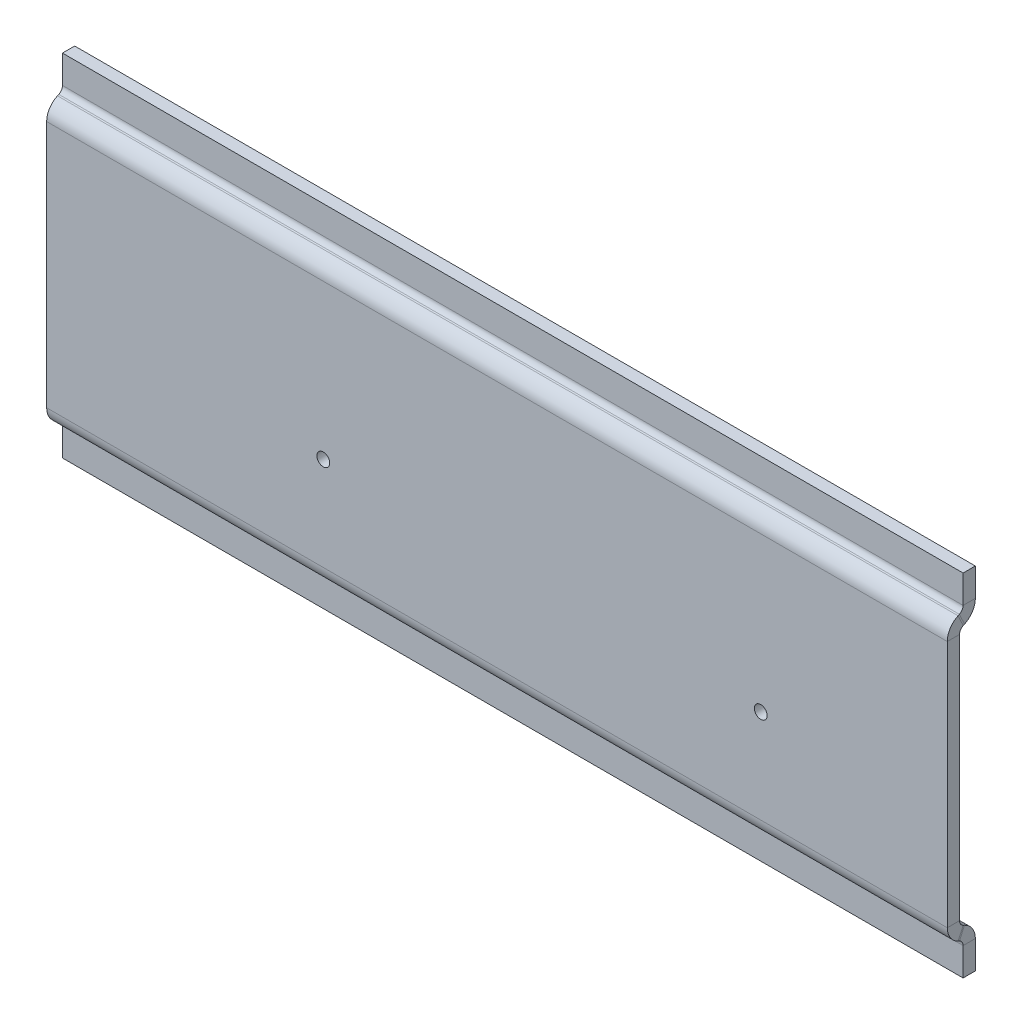
ISO-10303-21;
HEADER;
FILE_DESCRIPTION(('STEP AP214'),'2;1');
FILE_NAME('part.step','',(''),(''),'','','');
FILE_SCHEMA(('AUTOMOTIVE_DESIGN { 1 0 10303 214 1 1 1 1 }'));
ENDSEC;
DATA;
#1=APPLICATION_CONTEXT('core data for automotive mechanical design processes');
#2=APPLICATION_PROTOCOL_DEFINITION('international standard','automotive_design',2000,#1);
#3=PRODUCT_CONTEXT('',#1,'mechanical');
#4=PRODUCT('Part','Part','',(#3));
#5=PRODUCT_RELATED_PRODUCT_CATEGORY('part','',(#4));
#6=PRODUCT_DEFINITION_FORMATION('','',#4);
#7=PRODUCT_DEFINITION_CONTEXT('part definition',#1,'design');
#8=PRODUCT_DEFINITION('design','',#6,#7);
#9=PRODUCT_DEFINITION_SHAPE('','',#8);
#10=(LENGTH_UNIT() NAMED_UNIT(*) SI_UNIT(.MILLI.,.METRE.));
#11=(NAMED_UNIT(*) PLANE_ANGLE_UNIT() SI_UNIT($,.RADIAN.));
#12=(NAMED_UNIT(*) SI_UNIT($,.STERADIAN.) SOLID_ANGLE_UNIT());
#13=UNCERTAINTY_MEASURE_WITH_UNIT(LENGTH_MEASURE(1.E-05),#10,'distance_accuracy_value','');
#14=(GEOMETRIC_REPRESENTATION_CONTEXT(3) GLOBAL_UNCERTAINTY_ASSIGNED_CONTEXT((#13)) GLOBAL_UNIT_ASSIGNED_CONTEXT((#10,
#11,#12)) REPRESENTATION_CONTEXT('',''));
#15=CARTESIAN_POINT('',(0.,0.,0.));
#16=DIRECTION('',(0.,0.,1.));
#17=DIRECTION('',(1.,0.,0.));
#18=AXIS2_PLACEMENT_3D('',#15,#16,#17);
#19=CARTESIAN_POINT('',(0.,-0.259494141951947,-2.45648698324763));
#20=DIRECTION('',(1.,0.,0.));
#21=DIRECTION('',(0.,0.,-1.));
#22=AXIS2_PLACEMENT_3D('',#19,#20,#21);
#23=PLANE('',#22);
#24=DIRECTION('',(0.,0.906307787036649,-0.422618261740702));
#25=VECTOR('',#24,1.);
#26=CARTESIAN_POINT('',(0.,0.00974338427721139,-1.87910524498833));
#27=LINE('',#26,#25);
#28=CARTESIAN_POINT('',(0.,0.00974338427721139,-1.87910524498833));
#29=VERTEX_POINT('',#28);
#30=CARTESIAN_POINT('',(0.,1.73172817964684,-2.68207994229567));
#31=VERTEX_POINT('',#30);
#32=EDGE_CURVE('E271',#29,#31,#27,.T.);
#33=ORIENTED_EDGE('',*,*,#32,.F.);
#34=DIRECTION('',(0.,-0.422618261740704,-0.906307787036648));
#35=VECTOR('',#34,1.);
#36=CARTESIAN_POINT('',(0.,1.10217547162214,0.463622926509542));
#37=LINE('',#36,#35);
#38=CARTESIAN_POINT('',(0.,0.10519572442995,-1.67440704095196));
#39=VERTEX_POINT('',#38);
#40=EDGE_CURVE('E328',#39,#29,#37,.T.);
#41=ORIENTED_EDGE('',*,*,#40,.F.);
#42=DIRECTION('',(0.,0.906307787036648,-0.422618261740704));
#43=VECTOR('',#42,1.);
#44=CARTESIAN_POINT('',(0.,1.82718051979958,-2.4773817382593));
#45=LINE('',#44,#43);
#46=CARTESIAN_POINT('',(0.,1.82718051979958,-2.4773817382593));
#47=VERTEX_POINT('',#46);
#48=EDGE_CURVE('E339',#47,#39,#45,.F.);
#49=ORIENTED_EDGE('',*,*,#48,.F.);
#50=DIRECTION('',(0.,0.422618261740704,0.906307787036648));
#51=VECTOR('',#50,1.);
#52=CARTESIAN_POINT('',(0.,1.46249065341768,-3.25946168055497));
#53=LINE('',#52,#51);
#54=EDGE_CURVE('E333',#47,#31,#53,.F.);
#55=ORIENTED_EDGE('',*,*,#54,.T.);
#56=EDGE_LOOP('',(#33,#41,#49,#55));
#57=FACE_BOUND('',#56,.T.);
#58=ADVANCED_FACE('F77',(#57),#23,.F.);
#59=CARTESIAN_POINT('',(140.,0.374433250659108,-1.09702530269266));
#60=DIRECTION('',(-1.,0.,0.));
#61=DIRECTION('',(0.,0.,1.));
#62=AXIS2_PLACEMENT_3D('',#59,#60,#61);
#63=PLANE('',#62);
#64=DIRECTION('',(0.,0.906307787036649,-0.422618261740702));
#65=VECTOR('',#64,1.);
#66=CARTESIAN_POINT('',(140.,0.0097433842772038,-1.87910524498833));
#67=LINE('',#66,#65);
#68=CARTESIAN_POINT('',(140.,0.0097433842772038,-1.87910524498833));
#69=VERTEX_POINT('',#68);
#70=CARTESIAN_POINT('',(140.,1.73172817964684,-2.68207994229567));
#71=VERTEX_POINT('',#70);
#72=EDGE_CURVE('E264',#69,#71,#67,.T.);
#73=ORIENTED_EDGE('',*,*,#72,.T.);
#74=DIRECTION('',(0.,-0.422618261740704,-0.906307787036648));
#75=VECTOR('',#74,1.);
#76=CARTESIAN_POINT('',(140.,2.09641804602874,-1.9));
#77=LINE('',#76,#75);
#78=CARTESIAN_POINT('',(140.,1.82718051979958,-2.4773817382593));
#79=VERTEX_POINT('',#78);
#80=EDGE_CURVE('E331',#71,#79,#77,.F.);
#81=ORIENTED_EDGE('',*,*,#80,.T.);
#82=DIRECTION('',(0.,0.906307787036648,-0.422618261740704));
#83=VECTOR('',#82,1.);
#84=CARTESIAN_POINT('',(140.,0.10519572442995,-1.67440704095196));
#85=LINE('',#84,#83);
#86=CARTESIAN_POINT('',(140.,0.105195724429949,-1.67440704095196));
#87=VERTEX_POINT('',#86);
#88=EDGE_CURVE('E322',#79,#87,#85,.F.);
#89=ORIENTED_EDGE('',*,*,#88,.T.);
#90=DIRECTION('',(0.,0.422618261740704,0.906307787036648));
#91=VECTOR('',#90,1.);
#92=CARTESIAN_POINT('',(140.,1.10217547162214,0.463622926509542));
#93=LINE('',#92,#91);
#94=EDGE_CURVE('E325',#69,#87,#93,.T.);
#95=ORIENTED_EDGE('',*,*,#94,.F.);
#96=EDGE_LOOP('',(#73,#81,#89,#95));
#97=FACE_BOUND('',#96,.T.);
#98=ADVANCED_FACE('F494',(#97),#63,.F.);
#99=CARTESIAN_POINT('',(0.,1.10217547162214,0.463622926509542));
#100=DIRECTION('',(0.,0.906307787036648,-0.422618261740704));
#101=DIRECTION('',(0.,0.422618261740704,0.906307787036648));
#102=AXIS2_PLACEMENT_3D('',#99,#100,#101);
#103=PLANE('',#102);
#104=DIRECTION('',(1.,0.,0.));
#105=VECTOR('',#104,1.);
#106=CARTESIAN_POINT('',(140.,0.0097433842772038,-1.87910524498833));
#107=LINE('',#106,#105);
#108=EDGE_CURVE('E268',#69,#29,#107,.F.);
#109=ORIENTED_EDGE('',*,*,#108,.F.);
#110=ORIENTED_EDGE('',*,*,#94,.T.);
#111=DIRECTION('',(-1.,0.,0.));
#112=VECTOR('',#111,1.);
#113=CARTESIAN_POINT('',(140.,0.10519572442995,-1.67440704095196));
#114=LINE('',#113,#112);
#115=EDGE_CURVE('E336',#39,#87,#114,.F.);
#116=ORIENTED_EDGE('',*,*,#115,.F.);
#117=ORIENTED_EDGE('',*,*,#40,.T.);
#118=EDGE_LOOP('',(#109,#110,#116,#117));
#119=FACE_BOUND('',#118,.T.);
#120=ADVANCED_FACE('F485',(#119),#103,.F.);
#121=CARTESIAN_POINT('',(0.,2.82416026699177,-0.339351770797795));
#122=DIRECTION('',(0.,0.906307787036648,-0.422618261740704));
#123=DIRECTION('',(0.,0.422618261740704,0.906307787036648));
#124=AXIS2_PLACEMENT_3D('',#121,#122,#123);
#125=PLANE('',#124);
#126=ORIENTED_EDGE('',*,*,#80,.F.);
#127=DIRECTION('',(1.,0.,0.));
#128=VECTOR('',#127,1.);
#129=CARTESIAN_POINT('',(140.,1.73172817964684,-2.68207994229567));
#130=LINE('',#129,#128);
#131=EDGE_CURVE('E219',#71,#31,#130,.F.);
#132=ORIENTED_EDGE('',*,*,#131,.T.);
#133=ORIENTED_EDGE('',*,*,#54,.F.);
#134=DIRECTION('',(-1.,0.,0.));
#135=VECTOR('',#134,1.);
#136=CARTESIAN_POINT('',(140.,1.82718051979958,-2.4773817382593));
#137=LINE('',#136,#135);
#138=EDGE_CURVE('E342',#79,#47,#137,.T.);
#139=ORIENTED_EDGE('',*,*,#138,.F.);
#140=EDGE_LOOP('',(#126,#132,#133,#139));
#141=FACE_BOUND('',#140,.T.);
#142=ADVANCED_FACE('F478',(#141),#125,.T.);
#143=CARTESIAN_POINT('',(140.,44.2594941419519,-2.45648698324763));
#144=DIRECTION('',(-1.,0.,0.));
#145=DIRECTION('',(0.,0.,1.));
#146=AXIS2_PLACEMENT_3D('',#143,#144,#145);
#147=PLANE('',#146);
#148=DIRECTION('',(0.,-0.906307787036649,-0.422618261740702));
#149=VECTOR('',#148,1.);
#150=CARTESIAN_POINT('',(140.,43.9902566157228,-1.87910524498833));
#151=LINE('',#150,#149);
#152=CARTESIAN_POINT('',(140.,43.9902566157228,-1.87910524498833));
#153=VERTEX_POINT('',#152);
#154=CARTESIAN_POINT('',(140.,42.2682718203532,-2.68207994229566));
#155=VERTEX_POINT('',#154);
#156=EDGE_CURVE('E320',#153,#155,#151,.T.);
#157=ORIENTED_EDGE('',*,*,#156,.F.);
#158=DIRECTION('',(0.,0.422618261740703,-0.906307787036648));
#159=VECTOR('',#158,1.);
#160=CARTESIAN_POINT('',(140.,35.0391519414816,17.3166006751272));
#161=LINE('',#160,#159);
#162=CARTESIAN_POINT('',(140.,43.8948042755701,-1.67440704095196));
#163=VERTEX_POINT('',#162);
#164=EDGE_CURVE('E372',#163,#153,#161,.T.);
#165=ORIENTED_EDGE('',*,*,#164,.F.);
#166=DIRECTION('',(0.,-0.906307787036648,-0.422618261740703));
#167=VECTOR('',#166,1.);
#168=CARTESIAN_POINT('',(140.,42.1728194802004,-2.47738173825929));
#169=LINE('',#168,#167);
#170=CARTESIAN_POINT('',(140.,42.1728194802004,-2.4773817382593));
#171=VERTEX_POINT('',#170);
#172=EDGE_CURVE('E383',#171,#163,#169,.F.);
#173=ORIENTED_EDGE('',*,*,#172,.F.);
#174=DIRECTION('',(0.,-0.422618261740703,0.906307787036648));
#175=VECTOR('',#174,1.);
#176=CARTESIAN_POINT('',(140.,42.5375093465823,-3.25946168055497));
#177=LINE('',#176,#175);
#178=EDGE_CURVE('E377',#171,#155,#177,.F.);
#179=ORIENTED_EDGE('',*,*,#178,.T.);
#180=EDGE_LOOP('',(#157,#165,#173,#179));
#181=FACE_BOUND('',#180,.T.);
#182=ADVANCED_FACE('F438',(#181),#147,.F.);
#183=CARTESIAN_POINT('',(0.,43.6255667493409,-1.09702530269266));
#184=DIRECTION('',(1.,0.,0.));
#185=DIRECTION('',(0.,0.,-1.));
#186=AXIS2_PLACEMENT_3D('',#183,#184,#185);
#187=PLANE('',#186);
#188=DIRECTION('',(0.,-0.906307787036649,-0.422618261740702));
#189=VECTOR('',#188,1.);
#190=CARTESIAN_POINT('',(0.,43.9902566157228,-1.87910524498833));
#191=LINE('',#190,#189);
#192=CARTESIAN_POINT('',(0.,43.9902566157228,-1.87910524498833));
#193=VERTEX_POINT('',#192);
#194=CARTESIAN_POINT('',(0.,42.2682718203531,-2.68207994229567));
#195=VERTEX_POINT('',#194);
#196=EDGE_CURVE('E310',#193,#195,#191,.T.);
#197=ORIENTED_EDGE('',*,*,#196,.T.);
#198=DIRECTION('',(0.,0.422618261740703,-0.906307787036648));
#199=VECTOR('',#198,1.);
#200=CARTESIAN_POINT('',(0.,41.9035819539713,-1.89999999999999));
#201=LINE('',#200,#199);
#202=CARTESIAN_POINT('',(0.,42.1728194802004,-2.4773817382593));
#203=VERTEX_POINT('',#202);
#204=EDGE_CURVE('E375',#195,#203,#201,.F.);
#205=ORIENTED_EDGE('',*,*,#204,.T.);
#206=DIRECTION('',(0.,-0.906307787036648,-0.422618261740703));
#207=VECTOR('',#206,1.);
#208=CARTESIAN_POINT('',(0.,43.8948042755701,-1.67440704095196));
#209=LINE('',#208,#207);
#210=CARTESIAN_POINT('',(0.,43.8948042755701,-1.67440704095196));
#211=VERTEX_POINT('',#210);
#212=EDGE_CURVE('E366',#203,#211,#209,.F.);
#213=ORIENTED_EDGE('',*,*,#212,.T.);
#214=DIRECTION('',(0.,-0.422618261740703,0.906307787036648));
#215=VECTOR('',#214,1.);
#216=CARTESIAN_POINT('',(0.,35.0391519414816,17.3166006751272));
#217=LINE('',#216,#215);
#218=EDGE_CURVE('E369',#193,#211,#217,.T.);
#219=ORIENTED_EDGE('',*,*,#218,.F.);
#220=EDGE_LOOP('',(#197,#205,#213,#219));
#221=FACE_BOUND('',#220,.T.);
#222=ADVANCED_FACE('F453',(#221),#187,.F.);
#223=CARTESIAN_POINT('',(0.,35.0391519414816,17.3166006751272));
#224=DIRECTION('',(0.,-0.906307787036648,-0.422618261740703));
#225=DIRECTION('',(0.,0.422618261740703,-0.906307787036648));
#226=AXIS2_PLACEMENT_3D('',#223,#224,#225);
#227=PLANE('',#226);
#228=DIRECTION('',(-1.,0.,0.));
#229=VECTOR('',#228,1.);
#230=CARTESIAN_POINT('',(0.,43.9902566157228,-1.87910524498833));
#231=LINE('',#230,#229);
#232=EDGE_CURVE('E316',#193,#153,#231,.F.);
#233=ORIENTED_EDGE('',*,*,#232,.F.);
#234=ORIENTED_EDGE('',*,*,#218,.T.);
#235=DIRECTION('',(1.,0.,0.));
#236=VECTOR('',#235,1.);
#237=CARTESIAN_POINT('',(0.,43.8948042755701,-1.67440704095196));
#238=LINE('',#237,#236);
#239=EDGE_CURVE('E380',#163,#211,#238,.F.);
#240=ORIENTED_EDGE('',*,*,#239,.F.);
#241=ORIENTED_EDGE('',*,*,#164,.T.);
#242=EDGE_LOOP('',(#233,#234,#240,#241));
#243=FACE_BOUND('',#242,.T.);
#244=ADVANCED_FACE('F435',(#243),#227,.F.);
#245=CARTESIAN_POINT('',(0.,33.317167146112,16.5136259778198));
#246=DIRECTION('',(0.,-0.906307787036648,-0.422618261740703));
#247=DIRECTION('',(0.,0.422618261740703,-0.906307787036648));
#248=AXIS2_PLACEMENT_3D('',#245,#246,#247);
#249=PLANE('',#248);
#250=ORIENTED_EDGE('',*,*,#204,.F.);
#251=DIRECTION('',(-1.,0.,0.));
#252=VECTOR('',#251,1.);
#253=CARTESIAN_POINT('',(0.,42.2682718203531,-2.68207994229567));
#254=LINE('',#253,#252);
#255=EDGE_CURVE('E305',#195,#155,#254,.F.);
#256=ORIENTED_EDGE('',*,*,#255,.T.);
#257=ORIENTED_EDGE('',*,*,#178,.F.);
#258=DIRECTION('',(1.,0.,0.));
#259=VECTOR('',#258,1.);
#260=CARTESIAN_POINT('',(0.,42.1728194802004,-2.47738173825929));
#261=LINE('',#260,#259);
#262=EDGE_CURVE('E386',#203,#171,#261,.T.);
#263=ORIENTED_EDGE('',*,*,#262,.F.);
#264=EDGE_LOOP('',(#250,#256,#257,#263));
#265=FACE_BOUND('',#264,.T.);
#266=ADVANCED_FACE('F444',(#265),#249,.T.);
#267=CARTESIAN_POINT('',(0.,0.,-1.9));
#268=DIRECTION('',(0.,0.,-1.));
#269=DIRECTION('',(-1.,0.,0.));
#270=AXIS2_PLACEMENT_3D('',#267,#268,#269);
#271=PLANE('',#270);
#272=CARTESIAN_POINT('',(43.,17.2817399998281,-1.9));
#273=DIRECTION('',(0.,0.,-1.));
#274=DIRECTION('',(-1.,0.,0.));
#275=AXIS2_PLACEMENT_3D('',#272,#273,#274);
#276=CIRCLE('',#275,0.999999999999998);
#277=CARTESIAN_POINT('',(42.,17.2817399998281,-1.9));
#278=VERTEX_POINT('',#277);
#279=EDGE_CURVE('E512',#278,#278,#276,.T.);
#280=ORIENTED_EDGE('',*,*,#279,.F.);
#281=EDGE_LOOP('',(#280));
#282=FACE_BOUND('',#281,.T.);
#283=CARTESIAN_POINT('',(111.,17.2817399998281,-1.9));
#284=DIRECTION('',(0.,0.,-1.));
#285=DIRECTION('',(-1.,0.,0.));
#286=AXIS2_PLACEMENT_3D('',#283,#284,#285);
#287=CIRCLE('',#286,0.999999999999998);
#288=CARTESIAN_POINT('',(110.,17.2817399998281,-1.9));
#289=VERTEX_POINT('',#288);
#290=EDGE_CURVE('E504',#289,#289,#287,.T.);
#291=ORIENTED_EDGE('',*,*,#290,.F.);
#292=EDGE_LOOP('',(#291));
#293=FACE_BOUND('',#292,.T.);
#294=DIRECTION('',(0.,1.,0.));
#295=VECTOR('',#294,1.);
#296=CARTESIAN_POINT('',(140.,0.,-1.9));
#297=LINE('',#296,#295);
#298=CARTESIAN_POINT('',(140.,2.73348830683623,-1.9));
#299=VERTEX_POINT('',#298);
#300=CARTESIAN_POINT('',(140.,41.2665116931638,-1.9));
#301=VERTEX_POINT('',#300);
#302=EDGE_CURVE('E13',#299,#301,#297,.T.);
#303=ORIENTED_EDGE('',*,*,#302,.F.);
#304=DIRECTION('',(-1.,0.,0.));
#305=VECTOR('',#304,1.);
#306=CARTESIAN_POINT('',(0.,2.73348830683623,-1.9));
#307=LINE('',#306,#305);
#308=CARTESIAN_POINT('',(0.,2.73348830683623,-1.9));
#309=VERTEX_POINT('',#308);
#310=EDGE_CURVE('E358',#309,#299,#307,.F.);
#311=ORIENTED_EDGE('',*,*,#310,.F.);
#312=DIRECTION('',(0.,-1.,0.));
#313=VECTOR('',#312,1.);
#314=CARTESIAN_POINT('',(0.,0.,-1.9));
#315=LINE('',#314,#313);
#316=CARTESIAN_POINT('',(0.,41.2665116931638,-1.9));
#317=VERTEX_POINT('',#316);
#318=EDGE_CURVE('E86',#317,#309,#315,.T.);
#319=ORIENTED_EDGE('',*,*,#318,.F.);
#320=DIRECTION('',(1.,0.,0.));
#321=VECTOR('',#320,1.);
#322=CARTESIAN_POINT('',(140.,41.2665116931638,-1.9));
#323=LINE('',#322,#321);
#324=EDGE_CURVE('E402',#301,#317,#323,.F.);
#325=ORIENTED_EDGE('',*,*,#324,.F.);
#326=EDGE_LOOP('',(#303,#311,#319,#325));
#327=FACE_BOUND('',#326,.T.);
#328=ADVANCED_FACE('F464',(#282,#293,#327),#271,.T.);
#329=CARTESIAN_POINT('',(0.,0.,0.));
#330=DIRECTION('',(0.,0.,-1.));
#331=DIRECTION('',(-1.,0.,0.));
#332=AXIS2_PLACEMENT_3D('',#329,#330,#331);
#333=PLANE('',#332);
#334=CARTESIAN_POINT('',(43.,17.2817399998281,0.));
#335=DIRECTION('',(0.,0.,1.));
#336=DIRECTION('',(1.,0.,0.));
#337=AXIS2_PLACEMENT_3D('',#334,#335,#336);
#338=CIRCLE('',#337,0.999999999999998);
#339=CARTESIAN_POINT('',(44.,17.2817399998281,0.));
#340=VERTEX_POINT('',#339);
#341=EDGE_CURVE('E515',#340,#340,#338,.T.);
#342=ORIENTED_EDGE('',*,*,#341,.F.);
#343=EDGE_LOOP('',(#342));
#344=FACE_BOUND('',#343,.T.);
#345=CARTESIAN_POINT('',(111.,17.2817399998281,0.));
#346=DIRECTION('',(0.,0.,1.));
#347=DIRECTION('',(1.,0.,0.));
#348=AXIS2_PLACEMENT_3D('',#345,#346,#347);
#349=CIRCLE('',#348,0.999999999999998);
#350=CARTESIAN_POINT('',(112.,17.2817399998281,0.));
#351=VERTEX_POINT('',#350);
#352=EDGE_CURVE('E509',#351,#351,#349,.T.);
#353=ORIENTED_EDGE('',*,*,#352,.F.);
#354=EDGE_LOOP('',(#353));
#355=FACE_BOUND('',#354,.T.);
#356=DIRECTION('',(-1.,0.,0.));
#357=VECTOR('',#356,1.);
#358=CARTESIAN_POINT('',(0.,2.73348830683623,0.));
#359=LINE('',#358,#357);
#360=CARTESIAN_POINT('',(0.,2.73348830683623,0.));
#361=VERTEX_POINT('',#360);
#362=CARTESIAN_POINT('',(140.,2.73348830683623,0.));
#363=VERTEX_POINT('',#362);
#364=EDGE_CURVE('E346',#361,#363,#359,.F.);
#365=ORIENTED_EDGE('',*,*,#364,.T.);
#366=DIRECTION('',(0.,1.,0.));
#367=VECTOR('',#366,1.);
#368=CARTESIAN_POINT('',(140.,0.,0.));
#369=LINE('',#368,#367);
#370=CARTESIAN_POINT('',(140.,41.2665116931638,0.));
#371=VERTEX_POINT('',#370);
#372=EDGE_CURVE('E81',#363,#371,#369,.T.);
#373=ORIENTED_EDGE('',*,*,#372,.T.);
#374=DIRECTION('',(1.,0.,0.));
#375=VECTOR('',#374,1.);
#376=CARTESIAN_POINT('',(140.,41.2665116931638,0.));
#377=LINE('',#376,#375);
#378=CARTESIAN_POINT('',(0.,41.2665116931638,0.));
#379=VERTEX_POINT('',#378);
#380=EDGE_CURVE('E390',#371,#379,#377,.F.);
#381=ORIENTED_EDGE('',*,*,#380,.T.);
#382=DIRECTION('',(0.,-1.,0.));
#383=VECTOR('',#382,1.);
#384=CARTESIAN_POINT('',(0.,0.,0.));
#385=LINE('',#384,#383);
#386=EDGE_CURVE('E410',#379,#361,#385,.T.);
#387=ORIENTED_EDGE('',*,*,#386,.T.);
#388=EDGE_LOOP('',(#365,#373,#381,#387));
#389=FACE_BOUND('',#388,.T.);
#390=ADVANCED_FACE('F418',(#344,#355,#389),#333,.F.);
#391=CARTESIAN_POINT('',(0.,0.,-1.9));
#392=DIRECTION('',(-1.,0.,0.));
#393=DIRECTION('',(0.,0.,1.));
#394=AXIS2_PLACEMENT_3D('',#391,#392,#393);
#395=PLANE('',#394);
#396=ORIENTED_EDGE('',*,*,#318,.T.);
#397=DIRECTION('',(0.,0.,1.));
#398=VECTOR('',#397,1.);
#399=CARTESIAN_POINT('',(0.,2.73348830683623,-1.9));
#400=LINE('',#399,#398);
#401=EDGE_CURVE('E352',#309,#361,#400,.T.);
#402=ORIENTED_EDGE('',*,*,#401,.T.);
#403=ORIENTED_EDGE('',*,*,#386,.F.);
#404=DIRECTION('',(0.,0.,1.));
#405=VECTOR('',#404,1.);
#406=CARTESIAN_POINT('',(0.,41.2665116931638,-1.9));
#407=LINE('',#406,#405);
#408=EDGE_CURVE('E407',#317,#379,#407,.T.);
#409=ORIENTED_EDGE('',*,*,#408,.F.);
#410=EDGE_LOOP('',(#396,#402,#403,#409));
#411=FACE_BOUND('',#410,.T.);
#412=ADVANCED_FACE('F79',(#411),#395,.T.);
#413=CARTESIAN_POINT('',(140.,0.,-1.9));
#414=DIRECTION('',(1.,0.,0.));
#415=DIRECTION('',(0.,0.,-1.));
#416=AXIS2_PLACEMENT_3D('',#413,#414,#415);
#417=PLANE('',#416);
#418=DIRECTION('',(0.,0.,1.));
#419=VECTOR('',#418,1.);
#420=CARTESIAN_POINT('',(140.,2.73348830683623,-1.9));
#421=LINE('',#420,#419);
#422=EDGE_CURVE('E363',#299,#363,#421,.T.);
#423=ORIENTED_EDGE('',*,*,#422,.F.);
#424=ORIENTED_EDGE('',*,*,#302,.T.);
#425=DIRECTION('',(0.,0.,1.));
#426=VECTOR('',#425,1.);
#427=CARTESIAN_POINT('',(140.,41.2665116931638,-1.9));
#428=LINE('',#427,#426);
#429=EDGE_CURVE('E396',#301,#371,#428,.T.);
#430=ORIENTED_EDGE('',*,*,#429,.T.);
#431=ORIENTED_EDGE('',*,*,#372,.F.);
#432=EDGE_LOOP('',(#423,#424,#430,#431));
#433=FACE_BOUND('',#432,.T.);
#434=ADVANCED_FACE('F571',(#433),#417,.T.);
#435=CARTESIAN_POINT('',(0.,41.2665116931638,-2.9));
#436=DIRECTION('',(-1.,0.,0.));
#437=DIRECTION('',(0.,0.,1.));
#438=AXIS2_PLACEMENT_3D('',#435,#436,#437);
#439=PLANE('',#438);
#440=ORIENTED_EDGE('',*,*,#212,.F.);
#441=CARTESIAN_POINT('',(0.,41.2665116931638,-2.9));
#442=DIRECTION('',(1.,0.,0.));
#443=DIRECTION('',(0.,0.,-1.));
#444=AXIS2_PLACEMENT_3D('',#441,#442,#443);
#445=CIRCLE('',#444,0.999999999999997);
#446=EDGE_CURVE('E399',#317,#203,#445,.F.);
#447=ORIENTED_EDGE('',*,*,#446,.F.);
#448=ORIENTED_EDGE('',*,*,#408,.T.);
#449=CARTESIAN_POINT('',(0.,41.2665116931638,-2.9));
#450=DIRECTION('',(1.,0.,0.));
#451=DIRECTION('',(0.,0.,-1.));
#452=AXIS2_PLACEMENT_3D('',#449,#450,#451);
#453=CIRCLE('',#452,2.9);
#454=EDGE_CURVE('E392',#379,#211,#453,.F.);
#455=ORIENTED_EDGE('',*,*,#454,.T.);
#456=EDGE_LOOP('',(#440,#447,#448,#455));
#457=FACE_BOUND('',#456,.T.);
#458=ADVANCED_FACE('F457',(#457),#439,.T.);
#459=CARTESIAN_POINT('',(140.,41.2665116931638,-2.9));
#460=DIRECTION('',(-1.,0.,0.));
#461=DIRECTION('',(0.,0.,1.));
#462=AXIS2_PLACEMENT_3D('',#459,#460,#461);
#463=PLANE('',#462);
#464=CARTESIAN_POINT('',(140.,41.2665116931638,-2.9));
#465=DIRECTION('',(1.,0.,0.));
#466=DIRECTION('',(0.,0.,-1.));
#467=AXIS2_PLACEMENT_3D('',#464,#465,#466);
#468=CIRCLE('',#467,0.999999999999997);
#469=EDGE_CURVE('E371',#171,#301,#468,.T.);
#470=ORIENTED_EDGE('',*,*,#469,.F.);
#471=ORIENTED_EDGE('',*,*,#172,.T.);
#472=CARTESIAN_POINT('',(140.,41.2665116931638,-2.9));
#473=DIRECTION('',(1.,0.,0.));
#474=DIRECTION('',(0.,0.,-1.));
#475=AXIS2_PLACEMENT_3D('',#472,#473,#474);
#476=CIRCLE('',#475,2.9);
#477=EDGE_CURVE('E393',#163,#371,#476,.T.);
#478=ORIENTED_EDGE('',*,*,#477,.T.);
#479=ORIENTED_EDGE('',*,*,#429,.F.);
#480=EDGE_LOOP('',(#470,#471,#478,#479));
#481=FACE_BOUND('',#480,.T.);
#482=ADVANCED_FACE('F427',(#481),#463,.F.);
#483=CARTESIAN_POINT('',(140.,41.2665116931638,-2.9));
#484=DIRECTION('',(1.,0.,0.));
#485=DIRECTION('',(0.,0.906307787036648,0.422618261740703));
#486=AXIS2_PLACEMENT_3D('',#483,#484,#485);
#487=CYLINDRICAL_SURFACE('',#486,2.9);
#488=ORIENTED_EDGE('',*,*,#380,.F.);
#489=ORIENTED_EDGE('',*,*,#477,.F.);
#490=ORIENTED_EDGE('',*,*,#239,.T.);
#491=ORIENTED_EDGE('',*,*,#454,.F.);
#492=EDGE_LOOP('',(#488,#489,#490,#491));
#493=FACE_BOUND('',#492,.T.);
#494=ADVANCED_FACE('F423',(#493),#487,.T.);
#495=CARTESIAN_POINT('',(140.,41.2665116931638,-2.9));
#496=DIRECTION('',(1.,0.,0.));
#497=DIRECTION('',(0.,0.906307787036648,0.422618261740703));
#498=AXIS2_PLACEMENT_3D('',#495,#496,#497);
#499=CYLINDRICAL_SURFACE('',#498,0.999999999999997);
#500=ORIENTED_EDGE('',*,*,#324,.T.);
#501=ORIENTED_EDGE('',*,*,#446,.T.);
#502=ORIENTED_EDGE('',*,*,#262,.T.);
#503=ORIENTED_EDGE('',*,*,#469,.T.);
#504=EDGE_LOOP('',(#500,#501,#502,#503));
#505=FACE_BOUND('',#504,.T.);
#506=ADVANCED_FACE('F459',(#505),#499,.F.);
#507=CARTESIAN_POINT('',(140.,2.73348830683623,-2.9));
#508=DIRECTION('',(1.,0.,0.));
#509=DIRECTION('',(0.,0.,-1.));
#510=AXIS2_PLACEMENT_3D('',#507,#508,#509);
#511=PLANE('',#510);
#512=ORIENTED_EDGE('',*,*,#88,.F.);
#513=CARTESIAN_POINT('',(140.,2.73348830683623,-2.9));
#514=DIRECTION('',(-1.,0.,0.));
#515=DIRECTION('',(0.,0.,1.));
#516=AXIS2_PLACEMENT_3D('',#513,#514,#515);
#517=CIRCLE('',#516,1.);
#518=EDGE_CURVE('E355',#299,#79,#517,.F.);
#519=ORIENTED_EDGE('',*,*,#518,.F.);
#520=ORIENTED_EDGE('',*,*,#422,.T.);
#521=CARTESIAN_POINT('',(140.,2.73348830683623,-2.9));
#522=DIRECTION('',(-1.,0.,0.));
#523=DIRECTION('',(0.,0.,1.));
#524=AXIS2_PLACEMENT_3D('',#521,#522,#523);
#525=CIRCLE('',#524,2.9);
#526=EDGE_CURVE('E348',#363,#87,#525,.F.);
#527=ORIENTED_EDGE('',*,*,#526,.T.);
#528=EDGE_LOOP('',(#512,#519,#520,#527));
#529=FACE_BOUND('',#528,.T.);
#530=ADVANCED_FACE('F492',(#529),#511,.T.);
#531=CARTESIAN_POINT('',(0.,2.73348830683623,-2.9));
#532=DIRECTION('',(1.,0.,0.));
#533=DIRECTION('',(0.,0.,-1.));
#534=AXIS2_PLACEMENT_3D('',#531,#532,#533);
#535=PLANE('',#534);
#536=CARTESIAN_POINT('',(0.,2.73348830683623,-2.9));
#537=DIRECTION('',(-1.,0.,0.));
#538=DIRECTION('',(0.,0.,1.));
#539=AXIS2_PLACEMENT_3D('',#536,#537,#538);
#540=CIRCLE('',#539,1.);
#541=EDGE_CURVE('E327',#47,#309,#540,.T.);
#542=ORIENTED_EDGE('',*,*,#541,.F.);
#543=ORIENTED_EDGE('',*,*,#48,.T.);
#544=CARTESIAN_POINT('',(0.,2.73348830683623,-2.9));
#545=DIRECTION('',(-1.,0.,0.));
#546=DIRECTION('',(0.,0.,1.));
#547=AXIS2_PLACEMENT_3D('',#544,#545,#546);
#548=CIRCLE('',#547,2.9);
#549=EDGE_CURVE('E349',#39,#361,#548,.T.);
#550=ORIENTED_EDGE('',*,*,#549,.T.);
#551=ORIENTED_EDGE('',*,*,#401,.F.);
#552=EDGE_LOOP('',(#542,#543,#550,#551));
#553=FACE_BOUND('',#552,.T.);
#554=ADVANCED_FACE('F469',(#553),#535,.F.);
#555=CARTESIAN_POINT('',(0.,2.73348830683623,-2.9));
#556=DIRECTION('',(-1.,0.,0.));
#557=DIRECTION('',(0.,-0.906307787036648,0.422618261740704));
#558=AXIS2_PLACEMENT_3D('',#555,#556,#557);
#559=CYLINDRICAL_SURFACE('',#558,2.9);
#560=ORIENTED_EDGE('',*,*,#364,.F.);
#561=ORIENTED_EDGE('',*,*,#549,.F.);
#562=ORIENTED_EDGE('',*,*,#115,.T.);
#563=ORIENTED_EDGE('',*,*,#526,.F.);
#564=EDGE_LOOP('',(#560,#561,#562,#563));
#565=FACE_BOUND('',#564,.T.);
#566=ADVANCED_FACE('F489',(#565),#559,.T.);
#567=CARTESIAN_POINT('',(0.,2.73348830683623,-2.9));
#568=DIRECTION('',(-1.,0.,0.));
#569=DIRECTION('',(0.,-0.906307787036648,0.422618261740704));
#570=AXIS2_PLACEMENT_3D('',#567,#568,#569);
#571=CYLINDRICAL_SURFACE('',#570,1.);
#572=ORIENTED_EDGE('',*,*,#310,.T.);
#573=ORIENTED_EDGE('',*,*,#518,.T.);
#574=ORIENTED_EDGE('',*,*,#138,.T.);
#575=ORIENTED_EDGE('',*,*,#541,.T.);
#576=EDGE_LOOP('',(#572,#573,#574,#575));
#577=FACE_BOUND('',#576,.T.);
#578=ADVANCED_FACE('F472',(#577),#571,.F.);
#579=CARTESIAN_POINT('',(140.,44.8965644027594,-1.45648698324763));
#580=DIRECTION('',(1.,0.,0.));
#581=DIRECTION('',(0.,0.,-1.));
#582=AXIS2_PLACEMENT_3D('',#579,#580,#581);
#583=PLANE('',#582);
#584=DIRECTION('',(0.,0.,-1.));
#585=VECTOR('',#584,1.);
#586=CARTESIAN_POINT('',(140.,44.8965644027594,-2.45648698324764));
#587=LINE('',#586,#585);
#588=CARTESIAN_POINT('',(140.,44.8965644027594,-2.45648698324763));
#589=VERTEX_POINT('',#588);
#590=CARTESIAN_POINT('',(140.,44.8965644027594,-4.35648698324763));
#591=VERTEX_POINT('',#590);
#592=EDGE_CURVE('E273',#589,#591,#587,.T.);
#593=ORIENTED_EDGE('',*,*,#592,.F.);
#594=CARTESIAN_POINT('',(140.,44.8965644027594,-1.45648698324763));
#595=DIRECTION('',(-1.,0.,0.));
#596=DIRECTION('',(0.,0.,1.));
#597=AXIS2_PLACEMENT_3D('',#594,#595,#596);
#598=CIRCLE('',#597,0.999999999999995);
#599=EDGE_CURVE('E313',#153,#589,#598,.F.);
#600=ORIENTED_EDGE('',*,*,#599,.F.);
#601=ORIENTED_EDGE('',*,*,#156,.T.);
#602=CARTESIAN_POINT('',(140.,44.8965644027594,-1.45648698324763));
#603=DIRECTION('',(-1.,0.,0.));
#604=DIRECTION('',(0.,0.,1.));
#605=AXIS2_PLACEMENT_3D('',#602,#603,#604);
#606=CIRCLE('',#605,2.89999999999999);
#607=EDGE_CURVE('E102',#155,#591,#606,.F.);
#608=ORIENTED_EDGE('',*,*,#607,.T.);
#609=EDGE_LOOP('',(#593,#600,#601,#608));
#610=FACE_BOUND('',#609,.T.);
#611=ADVANCED_FACE('F441',(#610),#583,.T.);
#612=CARTESIAN_POINT('',(0.,44.8965644027594,-1.45648698324763));
#613=DIRECTION('',(1.,0.,0.));
#614=DIRECTION('',(0.,0.,-1.));
#615=AXIS2_PLACEMENT_3D('',#612,#613,#614);
#616=PLANE('',#615);
#617=CARTESIAN_POINT('',(0.,44.8965644027594,-1.45648698324763));
#618=DIRECTION('',(-1.,0.,0.));
#619=DIRECTION('',(0.,0.,1.));
#620=AXIS2_PLACEMENT_3D('',#617,#618,#619);
#621=CIRCLE('',#620,0.999999999999995);
#622=CARTESIAN_POINT('',(0.,44.8965644027594,-2.45648698324763));
#623=VERTEX_POINT('',#622);
#624=EDGE_CURVE('E304',#623,#193,#621,.T.);
#625=ORIENTED_EDGE('',*,*,#624,.F.);
#626=DIRECTION('',(0.,0.,-1.));
#627=VECTOR('',#626,1.);
#628=CARTESIAN_POINT('',(0.,44.8965644027594,-2.45648698324764));
#629=LINE('',#628,#627);
#630=CARTESIAN_POINT('',(0.,44.8965644027594,-4.35648698324763));
#631=VERTEX_POINT('',#630);
#632=EDGE_CURVE('E277',#623,#631,#629,.T.);
#633=ORIENTED_EDGE('',*,*,#632,.T.);
#634=CARTESIAN_POINT('',(0.,44.8965644027594,-1.45648698324763));
#635=DIRECTION('',(-1.,0.,0.));
#636=DIRECTION('',(0.,0.,1.));
#637=AXIS2_PLACEMENT_3D('',#634,#635,#636);
#638=CIRCLE('',#637,2.89999999999999);
#639=EDGE_CURVE('E308',#631,#195,#638,.T.);
#640=ORIENTED_EDGE('',*,*,#639,.T.);
#641=ORIENTED_EDGE('',*,*,#196,.F.);
#642=EDGE_LOOP('',(#625,#633,#640,#641));
#643=FACE_BOUND('',#642,.T.);
#644=ADVANCED_FACE('F449',(#643),#616,.F.);
#645=CARTESIAN_POINT('',(0.,44.8965644027594,-1.45648698324763));
#646=DIRECTION('',(-1.,0.,0.));
#647=DIRECTION('',(0.,0.,-1.));
#648=AXIS2_PLACEMENT_3D('',#645,#646,#647);
#649=CYLINDRICAL_SURFACE('',#648,2.89999999999999);
#650=ORIENTED_EDGE('',*,*,#255,.F.);
#651=ORIENTED_EDGE('',*,*,#639,.F.);
#652=DIRECTION('',(1.,0.,0.));
#653=VECTOR('',#652,1.);
#654=CARTESIAN_POINT('',(0.,44.8965644027594,-4.35648698324763));
#655=LINE('',#654,#653);
#656=EDGE_CURVE('E280',#631,#591,#655,.T.);
#657=ORIENTED_EDGE('',*,*,#656,.T.);
#658=ORIENTED_EDGE('',*,*,#607,.F.);
#659=EDGE_LOOP('',(#650,#651,#657,#658));
#660=FACE_BOUND('',#659,.T.);
#661=ADVANCED_FACE('F446',(#660),#649,.T.);
#662=CARTESIAN_POINT('',(0.,44.8965644027594,-1.45648698324763));
#663=DIRECTION('',(-1.,0.,0.));
#664=DIRECTION('',(0.,0.,-1.));
#665=AXIS2_PLACEMENT_3D('',#662,#663,#664);
#666=CYLINDRICAL_SURFACE('',#665,0.999999999999995);
#667=ORIENTED_EDGE('',*,*,#232,.T.);
#668=ORIENTED_EDGE('',*,*,#599,.T.);
#669=DIRECTION('',(-1.,0.,0.));
#670=VECTOR('',#669,1.);
#671=CARTESIAN_POINT('',(140.,44.8965644027594,-2.45648698324764));
#672=LINE('',#671,#670);
#673=EDGE_CURVE('E275',#589,#623,#672,.T.);
#674=ORIENTED_EDGE('',*,*,#673,.T.);
#675=ORIENTED_EDGE('',*,*,#624,.T.);
#676=EDGE_LOOP('',(#667,#668,#674,#675));
#677=FACE_BOUND('',#676,.T.);
#678=ADVANCED_FACE('F765',(#677),#666,.F.);
#679=CARTESIAN_POINT('',(140.,44.2594941419519,-4.35648698324763));
#680=DIRECTION('',(-1.,0.,0.));
#681=DIRECTION('',(0.,0.,1.));
#682=AXIS2_PLACEMENT_3D('',#679,#680,#681);
#683=PLANE('',#682);
#684=ORIENTED_EDGE('',*,*,#592,.T.);
#685=DIRECTION('',(0.,-1.,0.));
#686=VECTOR('',#685,1.);
#687=CARTESIAN_POINT('',(140.,44.2594941419519,-4.35648698324763));
#688=LINE('',#687,#686);
#689=CARTESIAN_POINT('',(140.,49.2594941419519,-4.35648698324763));
#690=VERTEX_POINT('',#689);
#691=EDGE_CURVE('E285',#690,#591,#688,.T.);
#692=ORIENTED_EDGE('',*,*,#691,.F.);
#693=DIRECTION('',(0.,0.,1.));
#694=VECTOR('',#693,1.);
#695=CARTESIAN_POINT('',(140.,49.2594941419519,-4.35648698324763));
#696=LINE('',#695,#694);
#697=CARTESIAN_POINT('',(140.,49.2594941419519,-2.45648698324763));
#698=VERTEX_POINT('',#697);
#699=EDGE_CURVE('E293',#690,#698,#696,.T.);
#700=ORIENTED_EDGE('',*,*,#699,.T.);
#701=DIRECTION('',(0.,-1.,0.));
#702=VECTOR('',#701,1.);
#703=CARTESIAN_POINT('',(140.,44.2594941419519,-2.45648698324763));
#704=LINE('',#703,#702);
#705=EDGE_CURVE('E284',#698,#589,#704,.T.);
#706=ORIENTED_EDGE('',*,*,#705,.T.);
#707=EDGE_LOOP('',(#684,#692,#700,#706));
#708=FACE_BOUND('',#707,.T.);
#709=ADVANCED_FACE('F775',(#708),#683,.F.);
#710=CARTESIAN_POINT('',(0.,49.2594941419519,-4.35648698324763));
#711=DIRECTION('',(1.,0.,0.));
#712=DIRECTION('',(0.,0.,-1.));
#713=AXIS2_PLACEMENT_3D('',#710,#711,#712);
#714=PLANE('',#713);
#715=ORIENTED_EDGE('',*,*,#632,.F.);
#716=DIRECTION('',(0.,1.,0.));
#717=VECTOR('',#716,1.);
#718=CARTESIAN_POINT('',(0.,49.2594941419519,-2.45648698324763));
#719=LINE('',#718,#717);
#720=CARTESIAN_POINT('',(0.,49.2594941419519,-2.45648698324763));
#721=VERTEX_POINT('',#720);
#722=EDGE_CURVE('E296',#623,#721,#719,.T.);
#723=ORIENTED_EDGE('',*,*,#722,.T.);
#724=DIRECTION('',(0.,0.,1.));
#725=VECTOR('',#724,1.);
#726=CARTESIAN_POINT('',(0.,49.2594941419519,-4.35648698324763));
#727=LINE('',#726,#725);
#728=CARTESIAN_POINT('',(0.,49.2594941419519,-4.35648698324763));
#729=VERTEX_POINT('',#728);
#730=EDGE_CURVE('E301',#729,#721,#727,.T.);
#731=ORIENTED_EDGE('',*,*,#730,.F.);
#732=DIRECTION('',(0.,1.,0.));
#733=VECTOR('',#732,1.);
#734=CARTESIAN_POINT('',(0.,49.2594941419519,-4.35648698324763));
#735=LINE('',#734,#733);
#736=EDGE_CURVE('E288',#631,#729,#735,.T.);
#737=ORIENTED_EDGE('',*,*,#736,.F.);
#738=EDGE_LOOP('',(#715,#723,#731,#737));
#739=FACE_BOUND('',#738,.T.);
#740=ADVANCED_FACE('F786',(#739),#714,.F.);
#741=CARTESIAN_POINT('',(0.,0.,-4.35648698324759));
#742=DIRECTION('',(0.,0.,1.));
#743=DIRECTION('',(0.,-1.,0.));
#744=AXIS2_PLACEMENT_3D('',#741,#742,#743);
#745=PLANE('',#744);
#746=ORIENTED_EDGE('',*,*,#656,.F.);
#747=ORIENTED_EDGE('',*,*,#736,.T.);
#748=DIRECTION('',(1.,0.,0.));
#749=VECTOR('',#748,1.);
#750=CARTESIAN_POINT('',(140.,49.2594941419519,-4.35648698324763));
#751=LINE('',#750,#749);
#752=EDGE_CURVE('E291',#729,#690,#751,.T.);
#753=ORIENTED_EDGE('',*,*,#752,.T.);
#754=ORIENTED_EDGE('',*,*,#691,.T.);
#755=EDGE_LOOP('',(#746,#747,#753,#754));
#756=FACE_BOUND('',#755,.T.);
#757=ADVANCED_FACE('F797',(#756),#745,.F.);
#758=CARTESIAN_POINT('',(0.,0.,-2.45648698324759));
#759=DIRECTION('',(0.,0.,1.));
#760=DIRECTION('',(0.,-1.,0.));
#761=AXIS2_PLACEMENT_3D('',#758,#759,#760);
#762=PLANE('',#761);
#763=ORIENTED_EDGE('',*,*,#722,.F.);
#764=ORIENTED_EDGE('',*,*,#673,.F.);
#765=ORIENTED_EDGE('',*,*,#705,.F.);
#766=DIRECTION('',(1.,0.,0.));
#767=VECTOR('',#766,1.);
#768=CARTESIAN_POINT('',(140.,49.2594941419519,-2.45648698324763));
#769=LINE('',#768,#767);
#770=EDGE_CURVE('E289',#721,#698,#769,.T.);
#771=ORIENTED_EDGE('',*,*,#770,.F.);
#772=EDGE_LOOP('',(#763,#764,#765,#771));
#773=FACE_BOUND('',#772,.T.);
#774=ADVANCED_FACE('F808',(#773),#762,.T.);
#775=CARTESIAN_POINT('',(140.,49.2594941419519,-4.35648698324763));
#776=DIRECTION('',(0.,-1.,0.));
#777=DIRECTION('',(0.,0.,-1.));
#778=AXIS2_PLACEMENT_3D('',#775,#776,#777);
#779=PLANE('',#778);
#780=ORIENTED_EDGE('',*,*,#770,.T.);
#781=ORIENTED_EDGE('',*,*,#699,.F.);
#782=ORIENTED_EDGE('',*,*,#752,.F.);
#783=ORIENTED_EDGE('',*,*,#730,.T.);
#784=EDGE_LOOP('',(#780,#781,#782,#783));
#785=FACE_BOUND('',#784,.T.);
#786=ADVANCED_FACE('F819',(#785),#779,.F.);
#787=CARTESIAN_POINT('',(0.,-0.896564402759442,-1.45648698324763));
#788=DIRECTION('',(-1.,0.,0.));
#789=DIRECTION('',(0.,-1.,0.));
#790=AXIS2_PLACEMENT_3D('',#787,#788,#789);
#791=PLANE('',#790);
#792=DIRECTION('',(0.,0.,-1.));
#793=VECTOR('',#792,1.);
#794=CARTESIAN_POINT('',(0.,-0.896564402759437,-2.45648698324764));
#795=LINE('',#794,#793);
#796=CARTESIAN_POINT('',(0.,-0.896564402759442,-2.45648698324764));
#797=VERTEX_POINT('',#796);
#798=CARTESIAN_POINT('',(0.,-0.896564402759442,-4.35648698324763));
#799=VERTEX_POINT('',#798);
#800=EDGE_CURVE('E501',#797,#799,#795,.T.);
#801=ORIENTED_EDGE('',*,*,#800,.F.);
#802=CARTESIAN_POINT('',(0.,-0.896564402759442,-1.45648698324763));
#803=DIRECTION('',(1.,0.,0.));
#804=DIRECTION('',(0.,1.,0.));
#805=AXIS2_PLACEMENT_3D('',#802,#803,#804);
#806=CIRCLE('',#805,1.00000000000001);
#807=EDGE_CURVE('E222',#29,#797,#806,.F.);
#808=ORIENTED_EDGE('',*,*,#807,.F.);
#809=ORIENTED_EDGE('',*,*,#32,.T.);
#810=CARTESIAN_POINT('',(0.,-0.896564402759442,-1.45648698324763));
#811=DIRECTION('',(1.,0.,0.));
#812=DIRECTION('',(0.,1.,0.));
#813=AXIS2_PLACEMENT_3D('',#810,#811,#812);
#814=CIRCLE('',#813,2.90000000000001);
#815=EDGE_CURVE('E94',#31,#799,#814,.F.);
#816=ORIENTED_EDGE('',*,*,#815,.T.);
#817=EDGE_LOOP('',(#801,#808,#809,#816));
#818=FACE_BOUND('',#817,.T.);
#819=ADVANCED_FACE('F830',(#818),#791,.T.);
#820=CARTESIAN_POINT('',(140.,-0.89656440275945,-1.45648698324763));
#821=DIRECTION('',(-1.,0.,0.));
#822=DIRECTION('',(0.,-1.,0.));
#823=AXIS2_PLACEMENT_3D('',#820,#821,#822);
#824=PLANE('',#823);
#825=CARTESIAN_POINT('',(140.,-0.89656440275945,-1.45648698324763));
#826=DIRECTION('',(1.,0.,0.));
#827=DIRECTION('',(0.,1.,0.));
#828=AXIS2_PLACEMENT_3D('',#825,#826,#827);
#829=CIRCLE('',#828,1.00000000000001);
#830=CARTESIAN_POINT('',(140.,-0.89656440275945,-2.45648698324764));
#831=VERTEX_POINT('',#830);
#832=EDGE_CURVE('E229',#831,#69,#829,.T.);
#833=ORIENTED_EDGE('',*,*,#832,.F.);
#834=DIRECTION('',(0.,0.,-1.));
#835=VECTOR('',#834,1.);
#836=CARTESIAN_POINT('',(140.,-0.896564402759441,-2.45648698324763));
#837=LINE('',#836,#835);
#838=CARTESIAN_POINT('',(140.,-0.896564402759428,-4.35648698324763));
#839=VERTEX_POINT('',#838);
#840=EDGE_CURVE('E226',#831,#839,#837,.T.);
#841=ORIENTED_EDGE('',*,*,#840,.T.);
#842=CARTESIAN_POINT('',(140.,-0.89656440275945,-1.45648698324763));
#843=DIRECTION('',(1.,0.,0.));
#844=DIRECTION('',(0.,1.,0.));
#845=AXIS2_PLACEMENT_3D('',#842,#843,#844);
#846=CIRCLE('',#845,2.90000000000001);
#847=EDGE_CURVE('E213',#839,#71,#846,.T.);
#848=ORIENTED_EDGE('',*,*,#847,.T.);
#849=ORIENTED_EDGE('',*,*,#72,.F.);
#850=EDGE_LOOP('',(#833,#841,#848,#849));
#851=FACE_BOUND('',#850,.T.);
#852=ADVANCED_FACE('F227',(#851),#824,.F.);
#853=CARTESIAN_POINT('',(140.,-0.89656440275945,-1.45648698324763));
#854=DIRECTION('',(1.,0.,0.));
#855=DIRECTION('',(0.,0.,-1.));
#856=AXIS2_PLACEMENT_3D('',#853,#854,#855);
#857=CYLINDRICAL_SURFACE('',#856,2.90000000000001);
#858=ORIENTED_EDGE('',*,*,#131,.F.);
#859=ORIENTED_EDGE('',*,*,#847,.F.);
#860=DIRECTION('',(-1.,0.,0.));
#861=VECTOR('',#860,1.);
#862=CARTESIAN_POINT('',(0.,-0.896564402759424,-4.35648698324763));
#863=LINE('',#862,#861);
#864=EDGE_CURVE('E217',#839,#799,#863,.T.);
#865=ORIENTED_EDGE('',*,*,#864,.T.);
#866=ORIENTED_EDGE('',*,*,#815,.F.);
#867=EDGE_LOOP('',(#858,#859,#865,#866));
#868=FACE_BOUND('',#867,.T.);
#869=ADVANCED_FACE('F215',(#868),#857,.T.);
#870=CARTESIAN_POINT('',(140.,-0.89656440275945,-1.45648698324763));
#871=DIRECTION('',(1.,0.,0.));
#872=DIRECTION('',(0.,0.,-1.));
#873=AXIS2_PLACEMENT_3D('',#870,#871,#872);
#874=CYLINDRICAL_SURFACE('',#873,1.00000000000001);
#875=ORIENTED_EDGE('',*,*,#108,.T.);
#876=ORIENTED_EDGE('',*,*,#807,.T.);
#877=DIRECTION('',(1.,0.,0.));
#878=VECTOR('',#877,1.);
#879=CARTESIAN_POINT('',(0.,-0.896564402759437,-2.45648698324764));
#880=LINE('',#879,#878);
#881=EDGE_CURVE('E233',#797,#831,#880,.T.);
#882=ORIENTED_EDGE('',*,*,#881,.T.);
#883=ORIENTED_EDGE('',*,*,#832,.T.);
#884=EDGE_LOOP('',(#875,#876,#882,#883));
#885=FACE_BOUND('',#884,.T.);
#886=ADVANCED_FACE('F496',(#885),#874,.F.);
#887=CARTESIAN_POINT('',(0.,-0.259494141951948,-4.35648698324763));
#888=DIRECTION('',(1.,0.,0.));
#889=DIRECTION('',(0.,1.,0.));
#890=AXIS2_PLACEMENT_3D('',#887,#888,#889);
#891=PLANE('',#890);
#892=ORIENTED_EDGE('',*,*,#800,.T.);
#893=DIRECTION('',(0.,1.,0.));
#894=VECTOR('',#893,1.);
#895=CARTESIAN_POINT('',(0.,-0.259494141951948,-4.35648698324763));
#896=LINE('',#895,#894);
#897=CARTESIAN_POINT('',(0.,-5.25949414195195,-4.35648698324763));
#898=VERTEX_POINT('',#897);
#899=EDGE_CURVE('E241',#898,#799,#896,.T.);
#900=ORIENTED_EDGE('',*,*,#899,.F.);
#901=DIRECTION('',(0.,0.,1.));
#902=VECTOR('',#901,1.);
#903=CARTESIAN_POINT('',(0.,-5.25949414195195,-4.35648698324763));
#904=LINE('',#903,#902);
#905=CARTESIAN_POINT('',(0.,-5.25949414195195,-2.45648698324764));
#906=VERTEX_POINT('',#905);
#907=EDGE_CURVE('E250',#898,#906,#904,.T.);
#908=ORIENTED_EDGE('',*,*,#907,.T.);
#909=DIRECTION('',(0.,1.,0.));
#910=VECTOR('',#909,1.);
#911=CARTESIAN_POINT('',(0.,-0.259494141951948,-2.45648698324764));
#912=LINE('',#911,#910);
#913=EDGE_CURVE('E242',#906,#797,#912,.T.);
#914=ORIENTED_EDGE('',*,*,#913,.T.);
#915=EDGE_LOOP('',(#892,#900,#908,#914));
#916=FACE_BOUND('',#915,.T.);
#917=ADVANCED_FACE('F869',(#916),#891,.F.);
#918=CARTESIAN_POINT('',(140.,-5.25949414195195,-4.35648698324763));
#919=DIRECTION('',(-1.,0.,0.));
#920=DIRECTION('',(0.,0.,1.));
#921=AXIS2_PLACEMENT_3D('',#918,#919,#920);
#922=PLANE('',#921);
#923=ORIENTED_EDGE('',*,*,#840,.F.);
#924=DIRECTION('',(0.,-1.,0.));
#925=VECTOR('',#924,1.);
#926=CARTESIAN_POINT('',(140.,-5.25949414195195,-2.45648698324764));
#927=LINE('',#926,#925);
#928=CARTESIAN_POINT('',(140.,-5.25949414195195,-2.45648698324764));
#929=VERTEX_POINT('',#928);
#930=EDGE_CURVE('E257',#831,#929,#927,.T.);
#931=ORIENTED_EDGE('',*,*,#930,.T.);
#932=DIRECTION('',(0.,0.,1.));
#933=VECTOR('',#932,1.);
#934=CARTESIAN_POINT('',(140.,-5.25949414195195,-4.35648698324763));
#935=LINE('',#934,#933);
#936=CARTESIAN_POINT('',(140.,-5.25949414195195,-4.35648698324763));
#937=VERTEX_POINT('',#936);
#938=EDGE_CURVE('E246',#937,#929,#935,.T.);
#939=ORIENTED_EDGE('',*,*,#938,.F.);
#940=DIRECTION('',(0.,-1.,0.));
#941=VECTOR('',#940,1.);
#942=CARTESIAN_POINT('',(140.,-5.25949414195195,-4.35648698324763));
#943=LINE('',#942,#941);
#944=EDGE_CURVE('E238',#839,#937,#943,.T.);
#945=ORIENTED_EDGE('',*,*,#944,.F.);
#946=EDGE_LOOP('',(#923,#931,#939,#945));
#947=FACE_BOUND('',#946,.T.);
#948=ADVANCED_FACE('F244',(#947),#922,.F.);
#949=CARTESIAN_POINT('',(0.,0.,-4.35648698324763));
#950=DIRECTION('',(0.,0.,1.));
#951=DIRECTION('',(1.,0.,0.));
#952=AXIS2_PLACEMENT_3D('',#949,#950,#951);
#953=PLANE('',#952);
#954=ORIENTED_EDGE('',*,*,#864,.F.);
#955=ORIENTED_EDGE('',*,*,#944,.T.);
#956=DIRECTION('',(-1.,0.,0.));
#957=VECTOR('',#956,1.);
#958=CARTESIAN_POINT('',(0.,-5.25949414195195,-4.35648698324763));
#959=LINE('',#958,#957);
#960=EDGE_CURVE('E248',#937,#898,#959,.T.);
#961=ORIENTED_EDGE('',*,*,#960,.T.);
#962=ORIENTED_EDGE('',*,*,#899,.T.);
#963=EDGE_LOOP('',(#954,#955,#961,#962));
#964=FACE_BOUND('',#963,.T.);
#965=ADVANCED_FACE('F237',(#964),#953,.F.);
#966=CARTESIAN_POINT('',(0.,0.,-2.45648698324764));
#967=DIRECTION('',(0.,0.,1.));
#968=DIRECTION('',(1.,0.,0.));
#969=AXIS2_PLACEMENT_3D('',#966,#967,#968);
#970=PLANE('',#969);
#971=ORIENTED_EDGE('',*,*,#930,.F.);
#972=ORIENTED_EDGE('',*,*,#881,.F.);
#973=ORIENTED_EDGE('',*,*,#913,.F.);
#974=DIRECTION('',(-1.,0.,0.));
#975=VECTOR('',#974,1.);
#976=CARTESIAN_POINT('',(0.,-5.25949414195195,-2.45648698324764));
#977=LINE('',#976,#975);
#978=EDGE_CURVE('E252',#929,#906,#977,.T.);
#979=ORIENTED_EDGE('',*,*,#978,.F.);
#980=EDGE_LOOP('',(#971,#972,#973,#979));
#981=FACE_BOUND('',#980,.T.);
#982=ADVANCED_FACE('F537',(#981),#970,.T.);
#983=CARTESIAN_POINT('',(0.,-5.25949414195195,-4.35648698324763));
#984=DIRECTION('',(0.,1.,0.));
#985=DIRECTION('',(0.,0.,1.));
#986=AXIS2_PLACEMENT_3D('',#983,#984,#985);
#987=PLANE('',#986);
#988=ORIENTED_EDGE('',*,*,#978,.T.);
#989=ORIENTED_EDGE('',*,*,#907,.F.);
#990=ORIENTED_EDGE('',*,*,#960,.F.);
#991=ORIENTED_EDGE('',*,*,#938,.T.);
#992=EDGE_LOOP('',(#988,#989,#990,#991));
#993=FACE_BOUND('',#992,.T.);
#994=ADVANCED_FACE('F528',(#993),#987,.F.);
#995=CARTESIAN_POINT('',(111.,17.2817399998281,-5.));
#996=DIRECTION('',(0.,0.,1.));
#997=DIRECTION('',(1.,0.,0.));
#998=AXIS2_PLACEMENT_3D('',#995,#996,#997);
#999=CYLINDRICAL_SURFACE('',#998,0.999999999999998);
#1000=ORIENTED_EDGE('',*,*,#290,.T.);
#1001=EDGE_LOOP('',(#1000));
#1002=FACE_BOUND('',#1001,.T.);
#1003=ORIENTED_EDGE('',*,*,#352,.T.);
#1004=EDGE_LOOP('',(#1003));
#1005=FACE_BOUND('',#1004,.T.);
#1006=ADVANCED_FACE('F526',(#1002,#1005),#999,.F.);
#1007=CARTESIAN_POINT('',(43.,17.2817399998281,-5.));
#1008=DIRECTION('',(0.,0.,1.));
#1009=DIRECTION('',(1.,0.,0.));
#1010=AXIS2_PLACEMENT_3D('',#1007,#1008,#1009);
#1011=CYLINDRICAL_SURFACE('',#1010,0.999999999999998);
#1012=ORIENTED_EDGE('',*,*,#279,.T.);
#1013=EDGE_LOOP('',(#1012));
#1014=FACE_BOUND('',#1013,.T.);
#1015=ORIENTED_EDGE('',*,*,#341,.T.);
#1016=EDGE_LOOP('',(#1015));
#1017=FACE_BOUND('',#1016,.T.);
#1018=ADVANCED_FACE('F519',(#1014,#1017),#1011,.F.);
#1019=CLOSED_SHELL('',(#58,#98,#120,#142,#182,#222,#244,#266,#328,#390,#412,#434,#458,#482,#494,
#506,#530,#554,#566,#578,#611,#644,#661,#678,#709,#740,#757,#774,#786,#819,#852,#869,#886,#917,
#948,#965,#982,#994,#1006,#1018));
#1020=MANIFOLD_SOLID_BREP('B2',#1019);
#1021=ADVANCED_BREP_SHAPE_REPRESENTATION('',(#18,#1020),#14);
#1022=SHAPE_DEFINITION_REPRESENTATION(#9,#1021);
ENDSEC;
END-ISO-10303-21;
